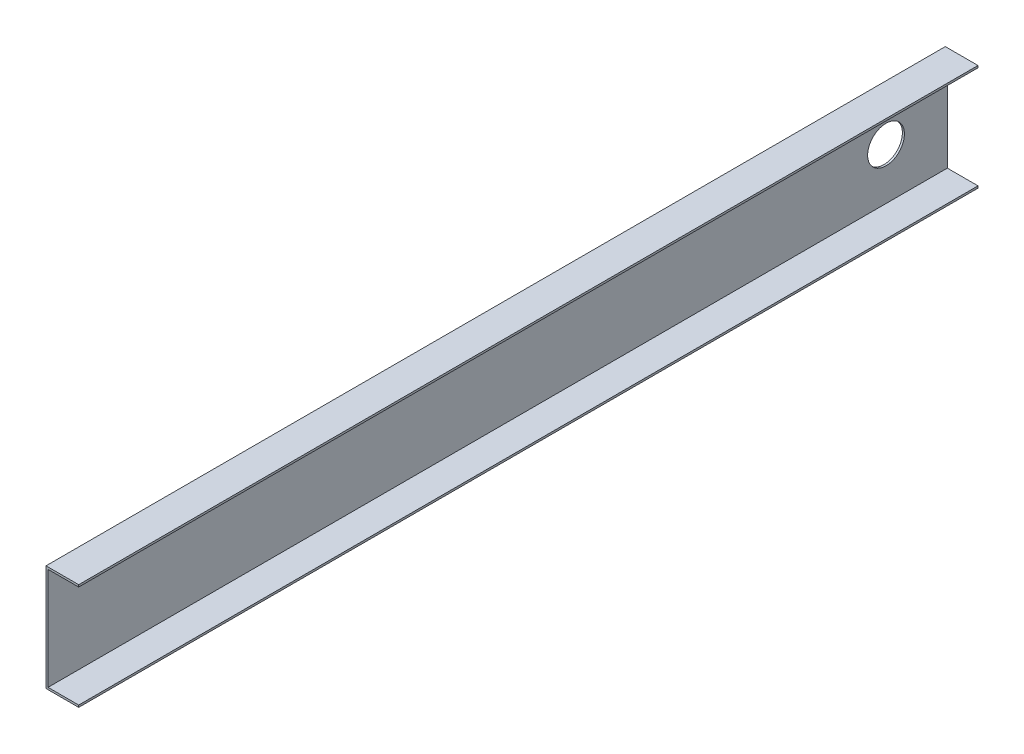
ISO-10303-21;
HEADER;
FILE_DESCRIPTION(('STEP AP214'),'2;1');
FILE_NAME('part.step','',(''),(''),'','','');
FILE_SCHEMA(('AUTOMOTIVE_DESIGN { 1 0 10303 214 1 1 1 1 }'));
ENDSEC;
DATA;
#1=APPLICATION_CONTEXT('core data for automotive mechanical design processes');
#2=APPLICATION_PROTOCOL_DEFINITION('international standard','automotive_design',2000,#1);
#3=PRODUCT_CONTEXT('',#1,'mechanical');
#4=PRODUCT('Part','Part','',(#3));
#5=PRODUCT_RELATED_PRODUCT_CATEGORY('part','',(#4));
#6=PRODUCT_DEFINITION_FORMATION('','',#4);
#7=PRODUCT_DEFINITION_CONTEXT('part definition',#1,'design');
#8=PRODUCT_DEFINITION('design','',#6,#7);
#9=PRODUCT_DEFINITION_SHAPE('','',#8);
#10=(LENGTH_UNIT() NAMED_UNIT(*) SI_UNIT(.MILLI.,.METRE.));
#11=(NAMED_UNIT(*) PLANE_ANGLE_UNIT() SI_UNIT($,.RADIAN.));
#12=(NAMED_UNIT(*) SI_UNIT($,.STERADIAN.) SOLID_ANGLE_UNIT());
#13=UNCERTAINTY_MEASURE_WITH_UNIT(LENGTH_MEASURE(1.E-05),#10,'distance_accuracy_value','');
#14=(GEOMETRIC_REPRESENTATION_CONTEXT(3) GLOBAL_UNCERTAINTY_ASSIGNED_CONTEXT((#13)) GLOBAL_UNIT_ASSIGNED_CONTEXT((#10,
#11,#12)) REPRESENTATION_CONTEXT('',''));
#15=CARTESIAN_POINT('',(0.,0.,0.));
#16=DIRECTION('',(0.,0.,1.));
#17=DIRECTION('',(1.,0.,0.));
#18=AXIS2_PLACEMENT_3D('',#15,#16,#17);
#19=CARTESIAN_POINT('',(7.99999999999999,13.,220.));
#20=DIRECTION('',(-1.,0.,0.));
#21=DIRECTION('',(0.,0.,1.));
#22=AXIS2_PLACEMENT_3D('',#19,#20,#21);
#23=PLANE('',#22);
#24=DIRECTION('',(0.,1.,0.));
#25=VECTOR('',#24,1.);
#26=CARTESIAN_POINT('',(7.99999999999999,13.,0.));
#27=LINE('',#26,#25);
#28=CARTESIAN_POINT('',(7.99999999999999,12.5,0.));
#29=VERTEX_POINT('',#28);
#30=CARTESIAN_POINT('',(7.99999999999999,13.,0.));
#31=VERTEX_POINT('',#30);
#32=EDGE_CURVE('E133',#29,#31,#27,.T.);
#33=ORIENTED_EDGE('',*,*,#32,.T.);
#34=DIRECTION('',(0.,0.,-1.));
#35=VECTOR('',#34,1.);
#36=CARTESIAN_POINT('',(7.99999999999999,13.,220.));
#37=LINE('',#36,#35);
#38=CARTESIAN_POINT('',(7.99999999999999,13.,220.));
#39=VERTEX_POINT('',#38);
#40=EDGE_CURVE('E11',#39,#31,#37,.T.);
#41=ORIENTED_EDGE('',*,*,#40,.F.);
#42=DIRECTION('',(0.,1.,0.));
#43=VECTOR('',#42,1.);
#44=CARTESIAN_POINT('',(7.99999999999999,13.,220.));
#45=LINE('',#44,#43);
#46=CARTESIAN_POINT('',(7.99999999999999,12.5,220.));
#47=VERTEX_POINT('',#46);
#48=EDGE_CURVE('E147',#47,#39,#45,.T.);
#49=ORIENTED_EDGE('',*,*,#48,.F.);
#50=DIRECTION('',(0.,0.,-1.));
#51=VECTOR('',#50,1.);
#52=CARTESIAN_POINT('',(7.99999999999999,12.5,220.));
#53=LINE('',#52,#51);
#54=EDGE_CURVE('E129',#47,#29,#53,.T.);
#55=ORIENTED_EDGE('',*,*,#54,.T.);
#56=EDGE_LOOP('',(#33,#41,#49,#55));
#57=FACE_BOUND('',#56,.T.);
#58=ADVANCED_FACE('F36',(#57),#23,.F.);
#59=CARTESIAN_POINT('',(7.99999999999999,13.,220.));
#60=DIRECTION('',(0.,-1.,0.));
#61=DIRECTION('',(1.,0.,0.));
#62=AXIS2_PLACEMENT_3D('',#59,#60,#61);
#63=PLANE('',#62);
#64=DIRECTION('',(-1.,0.,0.));
#65=VECTOR('',#64,1.);
#66=CARTESIAN_POINT('',(7.99999999999999,13.,0.));
#67=LINE('',#66,#65);
#68=CARTESIAN_POINT('',(0.,13.,0.));
#69=VERTEX_POINT('',#68);
#70=EDGE_CURVE('E136',#31,#69,#67,.T.);
#71=ORIENTED_EDGE('',*,*,#70,.T.);
#72=DIRECTION('',(0.,0.,-1.));
#73=VECTOR('',#72,1.);
#74=CARTESIAN_POINT('',(0.,13.,220.));
#75=LINE('',#74,#73);
#76=CARTESIAN_POINT('',(0.,13.,220.));
#77=VERTEX_POINT('',#76);
#78=EDGE_CURVE('E45',#77,#69,#75,.T.);
#79=ORIENTED_EDGE('',*,*,#78,.F.);
#80=DIRECTION('',(-1.,0.,0.));
#81=VECTOR('',#80,1.);
#82=CARTESIAN_POINT('',(7.99999999999999,13.,220.));
#83=LINE('',#82,#81);
#84=EDGE_CURVE('E96',#39,#77,#83,.T.);
#85=ORIENTED_EDGE('',*,*,#84,.F.);
#86=ORIENTED_EDGE('',*,*,#40,.T.);
#87=EDGE_LOOP('',(#71,#79,#85,#86));
#88=FACE_BOUND('',#87,.T.);
#89=ADVANCED_FACE('F198',(#88),#63,.F.);
#90=CARTESIAN_POINT('',(0.,13.,220.));
#91=DIRECTION('',(1.,0.,0.));
#92=DIRECTION('',(0.,1.,0.));
#93=AXIS2_PLACEMENT_3D('',#90,#91,#92);
#94=PLANE('',#93);
#95=CARTESIAN_POINT('',(0.,0.,15.));
#96=DIRECTION('',(-1.,0.,0.));
#97=DIRECTION('',(0.,-1.,0.));
#98=AXIS2_PLACEMENT_3D('',#95,#96,#97);
#99=CIRCLE('',#98,4.5);
#100=CARTESIAN_POINT('',(0.,-4.5,15.));
#101=VERTEX_POINT('',#100);
#102=EDGE_CURVE('E181',#101,#101,#99,.T.);
#103=ORIENTED_EDGE('',*,*,#102,.F.);
#104=EDGE_LOOP('',(#103));
#105=FACE_BOUND('',#104,.T.);
#106=DIRECTION('',(0.,-1.,0.));
#107=VECTOR('',#106,1.);
#108=CARTESIAN_POINT('',(0.,13.,0.));
#109=LINE('',#108,#107);
#110=CARTESIAN_POINT('',(0.,-13.,0.));
#111=VERTEX_POINT('',#110);
#112=EDGE_CURVE('E138',#69,#111,#109,.T.);
#113=ORIENTED_EDGE('',*,*,#112,.T.);
#114=DIRECTION('',(0.,0.,-1.));
#115=VECTOR('',#114,1.);
#116=CARTESIAN_POINT('',(0.,-13.,220.));
#117=LINE('',#116,#115);
#118=CARTESIAN_POINT('',(0.,-13.,220.));
#119=VERTEX_POINT('',#118);
#120=EDGE_CURVE('E154',#119,#111,#117,.T.);
#121=ORIENTED_EDGE('',*,*,#120,.F.);
#122=DIRECTION('',(0.,-1.,0.));
#123=VECTOR('',#122,1.);
#124=CARTESIAN_POINT('',(0.,13.,220.));
#125=LINE('',#124,#123);
#126=EDGE_CURVE('E163',#77,#119,#125,.T.);
#127=ORIENTED_EDGE('',*,*,#126,.F.);
#128=ORIENTED_EDGE('',*,*,#78,.T.);
#129=EDGE_LOOP('',(#113,#121,#127,#128));
#130=FACE_BOUND('',#129,.T.);
#131=ADVANCED_FACE('F161',(#105,#130),#94,.F.);
#132=CARTESIAN_POINT('',(0.,-13.,220.));
#133=DIRECTION('',(0.,1.,0.));
#134=DIRECTION('',(-1.,0.,0.));
#135=AXIS2_PLACEMENT_3D('',#132,#133,#134);
#136=PLANE('',#135);
#137=DIRECTION('',(1.,0.,0.));
#138=VECTOR('',#137,1.);
#139=CARTESIAN_POINT('',(0.,-13.,0.));
#140=LINE('',#139,#138);
#141=CARTESIAN_POINT('',(8.,-13.,0.));
#142=VERTEX_POINT('',#141);
#143=EDGE_CURVE('E140',#111,#142,#140,.T.);
#144=ORIENTED_EDGE('',*,*,#143,.T.);
#145=DIRECTION('',(0.,0.,-1.));
#146=VECTOR('',#145,1.);
#147=CARTESIAN_POINT('',(8.,-13.,220.));
#148=LINE('',#147,#146);
#149=CARTESIAN_POINT('',(8.,-13.,220.));
#150=VERTEX_POINT('',#149);
#151=EDGE_CURVE('E151',#150,#142,#148,.T.);
#152=ORIENTED_EDGE('',*,*,#151,.F.);
#153=DIRECTION('',(1.,0.,0.));
#154=VECTOR('',#153,1.);
#155=CARTESIAN_POINT('',(0.,-13.,220.));
#156=LINE('',#155,#154);
#157=EDGE_CURVE('E175',#119,#150,#156,.T.);
#158=ORIENTED_EDGE('',*,*,#157,.F.);
#159=ORIENTED_EDGE('',*,*,#120,.T.);
#160=EDGE_LOOP('',(#144,#152,#158,#159));
#161=FACE_BOUND('',#160,.T.);
#162=ADVANCED_FACE('F171',(#161),#136,.F.);
#163=CARTESIAN_POINT('',(8.,-13.,220.));
#164=DIRECTION('',(-1.,0.,0.));
#165=DIRECTION('',(0.,0.,1.));
#166=AXIS2_PLACEMENT_3D('',#163,#164,#165);
#167=PLANE('',#166);
#168=DIRECTION('',(0.,1.,0.));
#169=VECTOR('',#168,1.);
#170=CARTESIAN_POINT('',(8.,-13.,0.));
#171=LINE('',#170,#169);
#172=CARTESIAN_POINT('',(8.,-12.5,0.));
#173=VERTEX_POINT('',#172);
#174=EDGE_CURVE('E142',#142,#173,#171,.T.);
#175=ORIENTED_EDGE('',*,*,#174,.T.);
#176=DIRECTION('',(0.,0.,-1.));
#177=VECTOR('',#176,1.);
#178=CARTESIAN_POINT('',(8.,-12.5,220.));
#179=LINE('',#178,#177);
#180=CARTESIAN_POINT('',(8.,-12.5,220.));
#181=VERTEX_POINT('',#180);
#182=EDGE_CURVE('E124',#181,#173,#179,.T.);
#183=ORIENTED_EDGE('',*,*,#182,.F.);
#184=DIRECTION('',(0.,1.,0.));
#185=VECTOR('',#184,1.);
#186=CARTESIAN_POINT('',(8.,-13.,220.));
#187=LINE('',#186,#185);
#188=EDGE_CURVE('E115',#150,#181,#187,.T.);
#189=ORIENTED_EDGE('',*,*,#188,.F.);
#190=ORIENTED_EDGE('',*,*,#151,.T.);
#191=EDGE_LOOP('',(#175,#183,#189,#190));
#192=FACE_BOUND('',#191,.T.);
#193=ADVANCED_FACE('F174',(#192),#167,.F.);
#194=CARTESIAN_POINT('',(0.499999999999995,-12.5,220.));
#195=DIRECTION('',(0.,-1.,0.));
#196=DIRECTION('',(0.,0.,-1.));
#197=AXIS2_PLACEMENT_3D('',#194,#195,#196);
#198=PLANE('',#197);
#199=DIRECTION('',(-1.,0.,0.));
#200=VECTOR('',#199,1.);
#201=CARTESIAN_POINT('',(0.499999999999995,-12.5,0.));
#202=LINE('',#201,#200);
#203=CARTESIAN_POINT('',(0.499999999999995,-12.5,0.));
#204=VERTEX_POINT('',#203);
#205=EDGE_CURVE('E123',#173,#204,#202,.T.);
#206=ORIENTED_EDGE('',*,*,#205,.T.);
#207=DIRECTION('',(0.,0.,-1.));
#208=VECTOR('',#207,1.);
#209=CARTESIAN_POINT('',(0.499999999999995,-12.5,220.));
#210=LINE('',#209,#208);
#211=CARTESIAN_POINT('',(0.499999999999995,-12.5,220.));
#212=VERTEX_POINT('',#211);
#213=EDGE_CURVE('E120',#212,#204,#210,.T.);
#214=ORIENTED_EDGE('',*,*,#213,.F.);
#215=DIRECTION('',(-1.,0.,0.));
#216=VECTOR('',#215,1.);
#217=CARTESIAN_POINT('',(0.499999999999995,-12.5,220.));
#218=LINE('',#217,#216);
#219=EDGE_CURVE('E109',#181,#212,#218,.T.);
#220=ORIENTED_EDGE('',*,*,#219,.F.);
#221=ORIENTED_EDGE('',*,*,#182,.T.);
#222=EDGE_LOOP('',(#206,#214,#220,#221));
#223=FACE_BOUND('',#222,.T.);
#224=ADVANCED_FACE('F121',(#223),#198,.F.);
#225=CARTESIAN_POINT('',(0.499999999999995,12.5,220.));
#226=DIRECTION('',(-1.,0.,0.));
#227=DIRECTION('',(0.,0.,1.));
#228=AXIS2_PLACEMENT_3D('',#225,#226,#227);
#229=PLANE('',#228);
#230=CARTESIAN_POINT('',(0.499999999999995,0.,15.));
#231=DIRECTION('',(-1.,0.,0.));
#232=DIRECTION('',(0.,0.,1.));
#233=AXIS2_PLACEMENT_3D('',#230,#231,#232);
#234=CIRCLE('',#233,4.5);
#235=CARTESIAN_POINT('',(0.499999999999995,0.,19.5));
#236=VERTEX_POINT('',#235);
#237=EDGE_CURVE('E39',#236,#236,#234,.T.);
#238=ORIENTED_EDGE('',*,*,#237,.T.);
#239=EDGE_LOOP('',(#238));
#240=FACE_BOUND('',#239,.T.);
#241=DIRECTION('',(0.,1.,0.));
#242=VECTOR('',#241,1.);
#243=CARTESIAN_POINT('',(0.499999999999995,12.5,0.));
#244=LINE('',#243,#242);
#245=CARTESIAN_POINT('',(0.499999999999995,12.5,0.));
#246=VERTEX_POINT('',#245);
#247=EDGE_CURVE('E82',#204,#246,#244,.T.);
#248=ORIENTED_EDGE('',*,*,#247,.T.);
#249=DIRECTION('',(0.,0.,-1.));
#250=VECTOR('',#249,1.);
#251=CARTESIAN_POINT('',(0.499999999999995,12.5,220.));
#252=LINE('',#251,#250);
#253=CARTESIAN_POINT('',(0.499999999999995,12.5,220.));
#254=VERTEX_POINT('',#253);
#255=EDGE_CURVE('E125',#254,#246,#252,.T.);
#256=ORIENTED_EDGE('',*,*,#255,.F.);
#257=DIRECTION('',(0.,1.,0.));
#258=VECTOR('',#257,1.);
#259=CARTESIAN_POINT('',(0.499999999999995,12.5,220.));
#260=LINE('',#259,#258);
#261=EDGE_CURVE('E113',#212,#254,#260,.T.);
#262=ORIENTED_EDGE('',*,*,#261,.F.);
#263=ORIENTED_EDGE('',*,*,#213,.T.);
#264=EDGE_LOOP('',(#248,#256,#262,#263));
#265=FACE_BOUND('',#264,.T.);
#266=ADVANCED_FACE('F127',(#240,#265),#229,.F.);
#267=CARTESIAN_POINT('',(7.99999999999999,12.5,220.));
#268=DIRECTION('',(0.,1.,0.));
#269=DIRECTION('',(0.,0.,1.));
#270=AXIS2_PLACEMENT_3D('',#267,#268,#269);
#271=PLANE('',#270);
#272=DIRECTION('',(1.,0.,0.));
#273=VECTOR('',#272,1.);
#274=CARTESIAN_POINT('',(7.99999999999999,12.5,0.));
#275=LINE('',#274,#273);
#276=EDGE_CURVE('E88',#246,#29,#275,.T.);
#277=ORIENTED_EDGE('',*,*,#276,.T.);
#278=ORIENTED_EDGE('',*,*,#54,.F.);
#279=DIRECTION('',(1.,0.,0.));
#280=VECTOR('',#279,1.);
#281=CARTESIAN_POINT('',(7.99999999999999,12.5,220.));
#282=LINE('',#281,#280);
#283=EDGE_CURVE('E53',#254,#47,#282,.T.);
#284=ORIENTED_EDGE('',*,*,#283,.F.);
#285=ORIENTED_EDGE('',*,*,#255,.T.);
#286=EDGE_LOOP('',(#277,#278,#284,#285));
#287=FACE_BOUND('',#286,.T.);
#288=ADVANCED_FACE('F205',(#287),#271,.F.);
#289=CARTESIAN_POINT('',(0.,0.,220.));
#290=DIRECTION('',(0.,0.,-1.));
#291=DIRECTION('',(-1.,0.,0.));
#292=AXIS2_PLACEMENT_3D('',#289,#290,#291);
#293=PLANE('',#292);
#294=ORIENTED_EDGE('',*,*,#48,.T.);
#295=ORIENTED_EDGE('',*,*,#84,.T.);
#296=ORIENTED_EDGE('',*,*,#126,.T.);
#297=ORIENTED_EDGE('',*,*,#157,.T.);
#298=ORIENTED_EDGE('',*,*,#188,.T.);
#299=ORIENTED_EDGE('',*,*,#219,.T.);
#300=ORIENTED_EDGE('',*,*,#261,.T.);
#301=ORIENTED_EDGE('',*,*,#283,.T.);
#302=EDGE_LOOP('',(#294,#295,#296,#297,#298,#299,#300,#301));
#303=FACE_BOUND('',#302,.T.);
#304=ADVANCED_FACE('F111',(#303),#293,.F.);
#305=CARTESIAN_POINT('',(0.,0.,0.));
#306=DIRECTION('',(0.,0.,-1.));
#307=DIRECTION('',(-1.,0.,0.));
#308=AXIS2_PLACEMENT_3D('',#305,#306,#307);
#309=PLANE('',#308);
#310=ORIENTED_EDGE('',*,*,#32,.F.);
#311=ORIENTED_EDGE('',*,*,#276,.F.);
#312=ORIENTED_EDGE('',*,*,#247,.F.);
#313=ORIENTED_EDGE('',*,*,#205,.F.);
#314=ORIENTED_EDGE('',*,*,#174,.F.);
#315=ORIENTED_EDGE('',*,*,#143,.F.);
#316=ORIENTED_EDGE('',*,*,#112,.F.);
#317=ORIENTED_EDGE('',*,*,#70,.F.);
#318=EDGE_LOOP('',(#310,#311,#312,#313,#314,#315,#316,#317));
#319=FACE_BOUND('',#318,.T.);
#320=ADVANCED_FACE('F167',(#319),#309,.T.);
#321=CARTESIAN_POINT('',(10.,0.,15.));
#322=DIRECTION('',(-1.,0.,0.));
#323=DIRECTION('',(0.,-1.,0.));
#324=AXIS2_PLACEMENT_3D('',#321,#322,#323);
#325=CYLINDRICAL_SURFACE('',#324,4.5);
#326=ORIENTED_EDGE('',*,*,#102,.T.);
#327=EDGE_LOOP('',(#326));
#328=FACE_BOUND('',#327,.T.);
#329=ORIENTED_EDGE('',*,*,#237,.F.);
#330=EDGE_LOOP('',(#329));
#331=FACE_BOUND('',#330,.T.);
#332=ADVANCED_FACE('F189',(#328,#331),#325,.F.);
#333=CLOSED_SHELL('',(#58,#89,#131,#162,#193,#224,#266,#288,#304,#320,#332));
#334=MANIFOLD_SOLID_BREP('B2',#333);
#335=ADVANCED_BREP_SHAPE_REPRESENTATION('',(#18,#334),#14);
#336=SHAPE_DEFINITION_REPRESENTATION(#9,#335);
ENDSEC;
END-ISO-10303-21;
